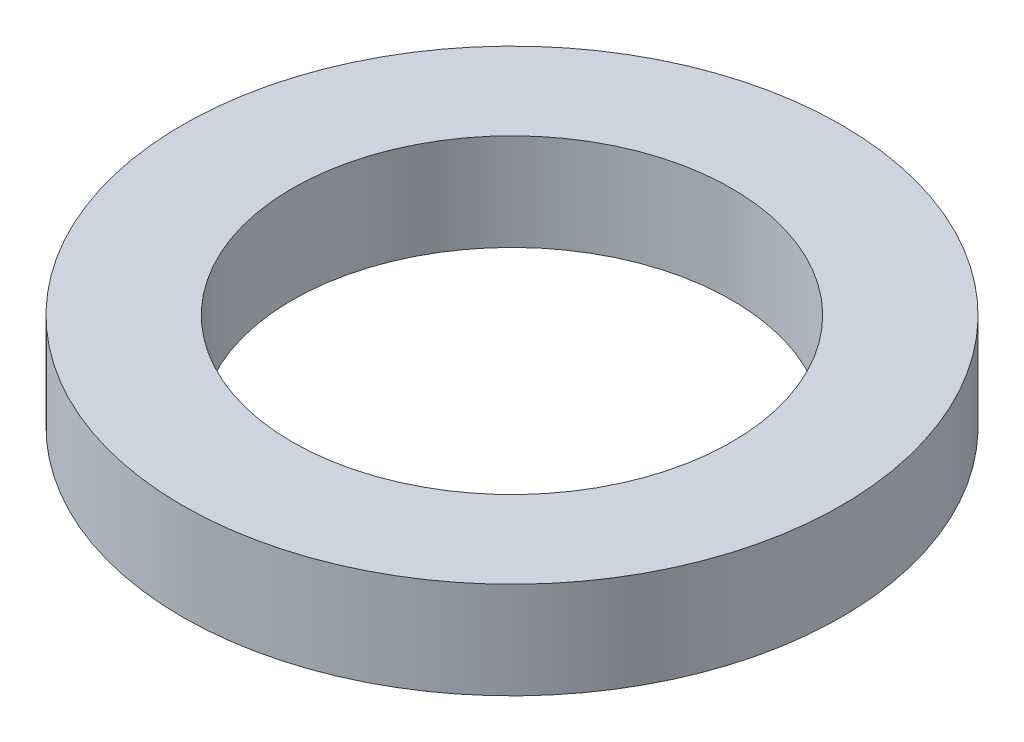
ISO-10303-21;
HEADER;
FILE_DESCRIPTION(('STEP AP214'),'2;1');
FILE_NAME('part.step','',(''),(''),'','','');
FILE_SCHEMA(('AUTOMOTIVE_DESIGN { 1 0 10303 214 1 1 1 1 }'));
ENDSEC;
DATA;
#1=APPLICATION_CONTEXT('core data for automotive mechanical design processes');
#2=APPLICATION_PROTOCOL_DEFINITION('international standard','automotive_design',2000,#1);
#3=PRODUCT_CONTEXT('',#1,'mechanical');
#4=PRODUCT('Part','Part','',(#3));
#5=PRODUCT_RELATED_PRODUCT_CATEGORY('part','',(#4));
#6=PRODUCT_DEFINITION_FORMATION('','',#4);
#7=PRODUCT_DEFINITION_CONTEXT('part definition',#1,'design');
#8=PRODUCT_DEFINITION('design','',#6,#7);
#9=PRODUCT_DEFINITION_SHAPE('','',#8);
#10=(LENGTH_UNIT() NAMED_UNIT(*) SI_UNIT(.MILLI.,.METRE.));
#11=(NAMED_UNIT(*) PLANE_ANGLE_UNIT() SI_UNIT($,.RADIAN.));
#12=(NAMED_UNIT(*) SI_UNIT($,.STERADIAN.) SOLID_ANGLE_UNIT());
#13=UNCERTAINTY_MEASURE_WITH_UNIT(LENGTH_MEASURE(1.E-05),#10,'distance_accuracy_value','');
#14=(GEOMETRIC_REPRESENTATION_CONTEXT(3) GLOBAL_UNCERTAINTY_ASSIGNED_CONTEXT((#13)) GLOBAL_UNIT_ASSIGNED_CONTEXT((#10,
#11,#12)) REPRESENTATION_CONTEXT('',''));
#15=CARTESIAN_POINT('',(0.,0.,0.));
#16=DIRECTION('',(0.,0.,1.));
#17=DIRECTION('',(1.,0.,0.));
#18=AXIS2_PLACEMENT_3D('',#15,#16,#17);
#19=CARTESIAN_POINT('',(0.,22.,0.));
#20=DIRECTION('',(0.,-1.,0.));
#21=DIRECTION('',(0.,0.,-1.));
#22=AXIS2_PLACEMENT_3D('',#19,#20,#21);
#23=CYLINDRICAL_SURFACE('',#22,75.);
#24=CARTESIAN_POINT('',(0.,22.,0.));
#25=DIRECTION('',(0.,1.,0.));
#26=DIRECTION('',(0.,0.,1.));
#27=AXIS2_PLACEMENT_3D('',#24,#25,#26);
#28=CIRCLE('',#27,75.);
#29=CARTESIAN_POINT('',(0.,22.,75.));
#30=VERTEX_POINT('',#29);
#31=EDGE_CURVE('E10',#30,#30,#28,.T.);
#32=ORIENTED_EDGE('',*,*,#31,.F.);
#33=EDGE_LOOP('',(#32));
#34=FACE_BOUND('',#33,.T.);
#35=CARTESIAN_POINT('',(0.,0.,0.));
#36=DIRECTION('',(0.,1.,0.));
#37=DIRECTION('',(0.,0.,1.));
#38=AXIS2_PLACEMENT_3D('',#35,#36,#37);
#39=CIRCLE('',#38,75.);
#40=CARTESIAN_POINT('',(0.,0.,75.));
#41=VERTEX_POINT('',#40);
#42=EDGE_CURVE('E37',#41,#41,#39,.T.);
#43=ORIENTED_EDGE('',*,*,#42,.T.);
#44=EDGE_LOOP('',(#43));
#45=FACE_BOUND('',#44,.T.);
#46=ADVANCED_FACE('F40',(#34,#45),#23,.T.);
#47=CARTESIAN_POINT('',(0.,22.,0.));
#48=DIRECTION('',(0.,1.,0.));
#49=DIRECTION('',(0.,0.,1.));
#50=AXIS2_PLACEMENT_3D('',#47,#48,#49);
#51=PLANE('',#50);
#52=CARTESIAN_POINT('',(0.,22.,0.));
#53=DIRECTION('',(0.,1.,0.));
#54=DIRECTION('',(0.,0.,1.));
#55=AXIS2_PLACEMENT_3D('',#52,#53,#54);
#56=CIRCLE('',#55,50.);
#57=CARTESIAN_POINT('',(0.,22.,50.));
#58=VERTEX_POINT('',#57);
#59=EDGE_CURVE('E50',#58,#58,#56,.T.);
#60=ORIENTED_EDGE('',*,*,#59,.F.);
#61=EDGE_LOOP('',(#60));
#62=FACE_BOUND('',#61,.T.);
#63=ORIENTED_EDGE('',*,*,#31,.T.);
#64=EDGE_LOOP('',(#63));
#65=FACE_BOUND('',#64,.T.);
#66=ADVANCED_FACE('F59',(#62,#65),#51,.T.);
#67=CARTESIAN_POINT('',(0.,0.,0.));
#68=DIRECTION('',(0.,1.,0.));
#69=DIRECTION('',(0.,0.,1.));
#70=AXIS2_PLACEMENT_3D('',#67,#68,#69);
#71=PLANE('',#70);
#72=CARTESIAN_POINT('',(0.,0.,0.));
#73=DIRECTION('',(0.,1.,0.));
#74=DIRECTION('',(0.,0.,1.));
#75=AXIS2_PLACEMENT_3D('',#72,#73,#74);
#76=CIRCLE('',#75,50.);
#77=CARTESIAN_POINT('',(0.,0.,50.));
#78=VERTEX_POINT('',#77);
#79=EDGE_CURVE('E47',#78,#78,#76,.T.);
#80=ORIENTED_EDGE('',*,*,#79,.T.);
#81=EDGE_LOOP('',(#80));
#82=FACE_BOUND('',#81,.T.);
#83=ORIENTED_EDGE('',*,*,#42,.F.);
#84=EDGE_LOOP('',(#83));
#85=FACE_BOUND('',#84,.T.);
#86=ADVANCED_FACE('F58',(#82,#85),#71,.F.);
#87=CARTESIAN_POINT('',(0.,22.,0.));
#88=DIRECTION('',(0.,-1.,0.));
#89=DIRECTION('',(0.,0.,-1.));
#90=AXIS2_PLACEMENT_3D('',#87,#88,#89);
#91=CYLINDRICAL_SURFACE('',#90,50.);
#92=ORIENTED_EDGE('',*,*,#59,.T.);
#93=EDGE_LOOP('',(#92));
#94=FACE_BOUND('',#93,.T.);
#95=ORIENTED_EDGE('',*,*,#79,.F.);
#96=EDGE_LOOP('',(#95));
#97=FACE_BOUND('',#96,.T.);
#98=ADVANCED_FACE('F54',(#94,#97),#91,.F.);
#99=CLOSED_SHELL('',(#46,#66,#86,#98));
#100=MANIFOLD_SOLID_BREP('B2',#99);
#101=ADVANCED_BREP_SHAPE_REPRESENTATION('',(#18,#100),#14);
#102=SHAPE_DEFINITION_REPRESENTATION(#9,#101);
ENDSEC;
END-ISO-10303-21;
